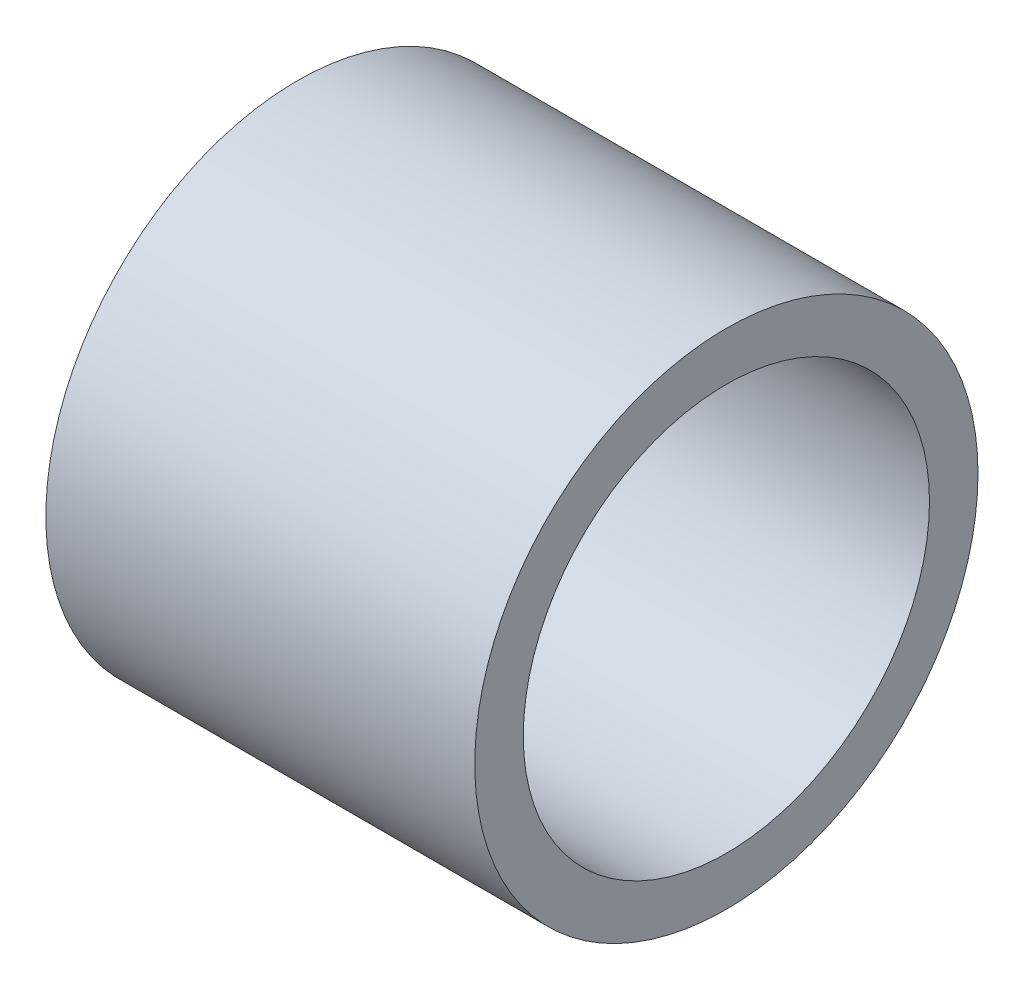
ISO-10303-21;
HEADER;
FILE_DESCRIPTION(('STEP AP214'),'2;1');
FILE_NAME('part.step','',(''),(''),'','','');
FILE_SCHEMA(('AUTOMOTIVE_DESIGN { 1 0 10303 214 1 1 1 1 }'));
ENDSEC;
DATA;
#1=APPLICATION_CONTEXT('core data for automotive mechanical design processes');
#2=APPLICATION_PROTOCOL_DEFINITION('international standard','automotive_design',2000,#1);
#3=PRODUCT_CONTEXT('',#1,'mechanical');
#4=PRODUCT('Part','Part','',(#3));
#5=PRODUCT_RELATED_PRODUCT_CATEGORY('part','',(#4));
#6=PRODUCT_DEFINITION_FORMATION('','',#4);
#7=PRODUCT_DEFINITION_CONTEXT('part definition',#1,'design');
#8=PRODUCT_DEFINITION('design','',#6,#7);
#9=PRODUCT_DEFINITION_SHAPE('','',#8);
#10=(LENGTH_UNIT() NAMED_UNIT(*) SI_UNIT(.MILLI.,.METRE.));
#11=(NAMED_UNIT(*) PLANE_ANGLE_UNIT() SI_UNIT($,.RADIAN.));
#12=(NAMED_UNIT(*) SI_UNIT($,.STERADIAN.) SOLID_ANGLE_UNIT());
#13=UNCERTAINTY_MEASURE_WITH_UNIT(LENGTH_MEASURE(1.E-05),#10,'distance_accuracy_value','');
#14=(GEOMETRIC_REPRESENTATION_CONTEXT(3) GLOBAL_UNCERTAINTY_ASSIGNED_CONTEXT((#13)) GLOBAL_UNIT_ASSIGNED_CONTEXT((#10,
#11,#12)) REPRESENTATION_CONTEXT('',''));
#15=CARTESIAN_POINT('',(0.,0.,0.));
#16=DIRECTION('',(0.,0.,1.));
#17=DIRECTION('',(1.,0.,0.));
#18=AXIS2_PLACEMENT_3D('',#15,#16,#17);
#19=CARTESIAN_POINT('',(14.2875,0.,0.));
#20=DIRECTION('',(1.,0.,0.));
#21=DIRECTION('',(0.,0.,-1.));
#22=AXIS2_PLACEMENT_3D('',#19,#20,#21);
#23=PLANE('',#22);
#24=CARTESIAN_POINT('',(14.2875,0.,0.));
#25=DIRECTION('',(1.,0.,0.));
#26=DIRECTION('',(0.,0.,-1.));
#27=AXIS2_PLACEMENT_3D('',#24,#25,#26);
#28=CIRCLE('',#27,8.382);
#29=CARTESIAN_POINT('',(14.2875,0.,-8.382));
#30=VERTEX_POINT('',#29);
#31=EDGE_CURVE('E10',#30,#30,#28,.T.);
#32=ORIENTED_EDGE('',*,*,#31,.T.);
#33=EDGE_LOOP('',(#32));
#34=FACE_BOUND('',#33,.T.);
#35=CARTESIAN_POINT('',(14.2875,0.,0.));
#36=DIRECTION('',(1.,0.,0.));
#37=DIRECTION('',(0.,0.,-1.));
#38=AXIS2_PLACEMENT_3D('',#35,#36,#37);
#39=CIRCLE('',#38,6.765925);
#40=CARTESIAN_POINT('',(14.2875,0.,-6.765925));
#41=VERTEX_POINT('',#40);
#42=EDGE_CURVE('E42',#41,#41,#39,.T.);
#43=ORIENTED_EDGE('',*,*,#42,.F.);
#44=EDGE_LOOP('',(#43));
#45=FACE_BOUND('',#44,.T.);
#46=ADVANCED_FACE('F31',(#34,#45),#23,.T.);
#47=CARTESIAN_POINT('',(0.,0.,0.));
#48=DIRECTION('',(1.,0.,0.));
#49=DIRECTION('',(0.,0.,-1.));
#50=AXIS2_PLACEMENT_3D('',#47,#48,#49);
#51=PLANE('',#50);
#52=CARTESIAN_POINT('',(0.,0.,0.));
#53=DIRECTION('',(1.,0.,0.));
#54=DIRECTION('',(0.,0.,-1.));
#55=AXIS2_PLACEMENT_3D('',#52,#53,#54);
#56=CIRCLE('',#55,8.382);
#57=CARTESIAN_POINT('',(0.,0.,-8.382));
#58=VERTEX_POINT('',#57);
#59=EDGE_CURVE('E35',#58,#58,#56,.T.);
#60=ORIENTED_EDGE('',*,*,#59,.F.);
#61=EDGE_LOOP('',(#60));
#62=FACE_BOUND('',#61,.T.);
#63=CARTESIAN_POINT('',(0.,0.,0.));
#64=DIRECTION('',(1.,0.,0.));
#65=DIRECTION('',(0.,0.,-1.));
#66=AXIS2_PLACEMENT_3D('',#63,#64,#65);
#67=CIRCLE('',#66,6.765925);
#68=CARTESIAN_POINT('',(0.,0.,-6.765925));
#69=VERTEX_POINT('',#68);
#70=EDGE_CURVE('E44',#69,#69,#67,.T.);
#71=ORIENTED_EDGE('',*,*,#70,.T.);
#72=EDGE_LOOP('',(#71));
#73=FACE_BOUND('',#72,.T.);
#74=ADVANCED_FACE('F54',(#62,#73),#51,.F.);
#75=CARTESIAN_POINT('',(14.2875,0.,0.));
#76=DIRECTION('',(-1.,0.,0.));
#77=DIRECTION('',(0.,0.,1.));
#78=AXIS2_PLACEMENT_3D('',#75,#76,#77);
#79=CYLINDRICAL_SURFACE('',#78,8.382);
#80=ORIENTED_EDGE('',*,*,#31,.F.);
#81=EDGE_LOOP('',(#80));
#82=FACE_BOUND('',#81,.T.);
#83=ORIENTED_EDGE('',*,*,#59,.T.);
#84=EDGE_LOOP('',(#83));
#85=FACE_BOUND('',#84,.T.);
#86=ADVANCED_FACE('F33',(#82,#85),#79,.T.);
#87=CARTESIAN_POINT('',(14.2875,0.,0.));
#88=DIRECTION('',(-1.,0.,0.));
#89=DIRECTION('',(0.,0.,1.));
#90=AXIS2_PLACEMENT_3D('',#87,#88,#89);
#91=CYLINDRICAL_SURFACE('',#90,6.765925);
#92=ORIENTED_EDGE('',*,*,#42,.T.);
#93=EDGE_LOOP('',(#92));
#94=FACE_BOUND('',#93,.T.);
#95=ORIENTED_EDGE('',*,*,#70,.F.);
#96=EDGE_LOOP('',(#95));
#97=FACE_BOUND('',#96,.T.);
#98=ADVANCED_FACE('F50',(#94,#97),#91,.F.);
#99=CLOSED_SHELL('',(#46,#74,#86,#98));
#100=MANIFOLD_SOLID_BREP('B2',#99);
#101=ADVANCED_BREP_SHAPE_REPRESENTATION('',(#18,#100),#14);
#102=SHAPE_DEFINITION_REPRESENTATION(#9,#101);
ENDSEC;
END-ISO-10303-21;
